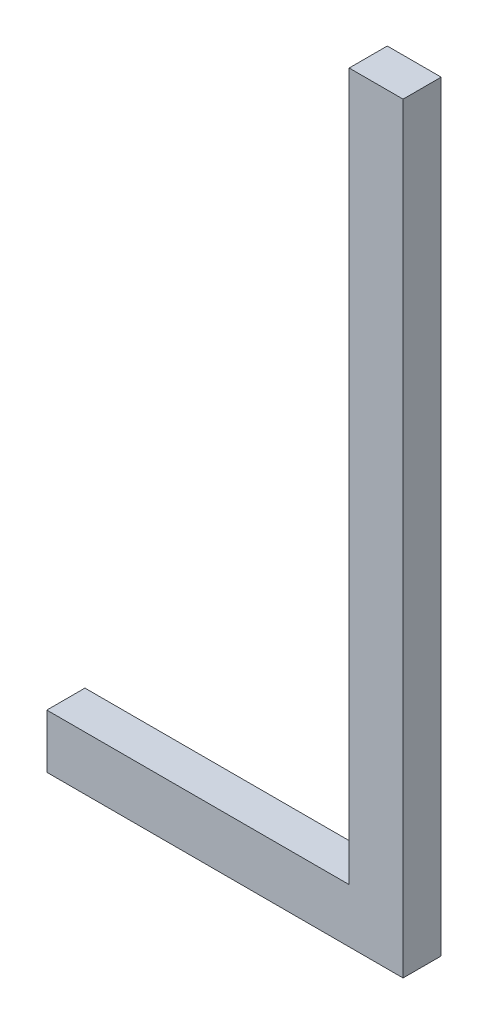
ISO-10303-21;
HEADER;
FILE_DESCRIPTION(('STEP AP214'),'2;1');
FILE_NAME('part.step','',(''),(''),'','','');
FILE_SCHEMA(('AUTOMOTIVE_DESIGN { 1 0 10303 214 1 1 1 1 }'));
ENDSEC;
DATA;
#1=APPLICATION_CONTEXT('core data for automotive mechanical design processes');
#2=APPLICATION_PROTOCOL_DEFINITION('international standard','automotive_design',2000,#1);
#3=PRODUCT_CONTEXT('',#1,'mechanical');
#4=PRODUCT('Part','Part','',(#3));
#5=PRODUCT_RELATED_PRODUCT_CATEGORY('part','',(#4));
#6=PRODUCT_DEFINITION_FORMATION('','',#4);
#7=PRODUCT_DEFINITION_CONTEXT('part definition',#1,'design');
#8=PRODUCT_DEFINITION('design','',#6,#7);
#9=PRODUCT_DEFINITION_SHAPE('','',#8);
#10=(LENGTH_UNIT() NAMED_UNIT(*) SI_UNIT(.MILLI.,.METRE.));
#11=(NAMED_UNIT(*) PLANE_ANGLE_UNIT() SI_UNIT($,.RADIAN.));
#12=(NAMED_UNIT(*) SI_UNIT($,.STERADIAN.) SOLID_ANGLE_UNIT());
#13=UNCERTAINTY_MEASURE_WITH_UNIT(LENGTH_MEASURE(1.E-05),#10,'distance_accuracy_value','');
#14=(GEOMETRIC_REPRESENTATION_CONTEXT(3) GLOBAL_UNCERTAINTY_ASSIGNED_CONTEXT((#13)) GLOBAL_UNIT_ASSIGNED_CONTEXT((#10,
#11,#12)) REPRESENTATION_CONTEXT('',''));
#15=CARTESIAN_POINT('',(0.,0.,0.));
#16=DIRECTION('',(0.,0.,1.));
#17=DIRECTION('',(1.,0.,0.));
#18=AXIS2_PLACEMENT_3D('',#15,#16,#17);
#19=CARTESIAN_POINT('',(64.7428887893903,65.7791772221511,-39.1));
#20=DIRECTION('',(0.,0.,1.));
#21=DIRECTION('',(1.,0.,0.));
#22=AXIS2_PLACEMENT_3D('',#19,#20,#21);
#23=PLANE('',#22);
#24=DIRECTION('',(1.,0.,0.));
#25=VECTOR('',#24,1.);
#26=CARTESIAN_POINT('',(64.7428887893903,65.9206474024611,-39.1));
#27=LINE('',#26,#25);
#28=CARTESIAN_POINT('',(65.5362313691903,65.9206474024611,-39.1));
#29=VERTEX_POINT('',#28);
#30=CARTESIAN_POINT('',(64.7428887893903,65.9206474024611,-39.1));
#31=VERTEX_POINT('',#30);
#32=EDGE_CURVE('E20',#29,#31,#27,.F.);
#33=ORIENTED_EDGE('',*,*,#32,.F.);
#34=DIRECTION('',(0.,1.,0.));
#35=VECTOR('',#34,1.);
#36=CARTESIAN_POINT('',(65.5362313691903,67.7764032970511,-39.1));
#37=LINE('',#36,#35);
#38=CARTESIAN_POINT('',(65.5362313691903,67.7764032970511,-39.1));
#39=VERTEX_POINT('',#38);
#40=EDGE_CURVE('E100',#29,#39,#37,.T.);
#41=ORIENTED_EDGE('',*,*,#40,.T.);
#42=DIRECTION('',(1.,0.,0.));
#43=VECTOR('',#42,1.);
#44=CARTESIAN_POINT('',(65.6777015494903,67.7764032970511,-39.1));
#45=LINE('',#44,#43);
#46=CARTESIAN_POINT('',(65.6777015494903,67.7764032970511,-39.1));
#47=VERTEX_POINT('',#46);
#48=EDGE_CURVE('E96',#39,#47,#45,.T.);
#49=ORIENTED_EDGE('',*,*,#48,.T.);
#50=DIRECTION('',(0.,1.,0.));
#51=VECTOR('',#50,1.);
#52=CARTESIAN_POINT('',(65.6777015494903,65.7791772221511,-39.1));
#53=LINE('',#52,#51);
#54=CARTESIAN_POINT('',(65.6777015494903,65.7791772221511,-39.1));
#55=VERTEX_POINT('',#54);
#56=EDGE_CURVE('E82',#47,#55,#53,.F.);
#57=ORIENTED_EDGE('',*,*,#56,.T.);
#58=DIRECTION('',(1.,0.,0.));
#59=VECTOR('',#58,1.);
#60=CARTESIAN_POINT('',(64.7428887893903,65.7791772221511,-39.1));
#61=LINE('',#60,#59);
#62=CARTESIAN_POINT('',(64.7428887893903,65.7791772221511,-39.1));
#63=VERTEX_POINT('',#62);
#64=EDGE_CURVE('E68',#55,#63,#61,.F.);
#65=ORIENTED_EDGE('',*,*,#64,.T.);
#66=DIRECTION('',(0.,1.,0.));
#67=VECTOR('',#66,1.);
#68=CARTESIAN_POINT('',(64.7428887893903,65.9206474024611,-39.1));
#69=LINE('',#68,#67);
#70=EDGE_CURVE('E74',#63,#31,#69,.T.);
#71=ORIENTED_EDGE('',*,*,#70,.T.);
#72=EDGE_LOOP('',(#33,#41,#49,#57,#65,#71));
#73=FACE_BOUND('',#72,.T.);
#74=ADVANCED_FACE('F17',(#73),#23,.F.);
#75=CARTESIAN_POINT('',(64.7428887893903,65.9206474024611,-39.));
#76=DIRECTION('',(1.,0.,0.));
#77=DIRECTION('',(0.,0.,-1.));
#78=AXIS2_PLACEMENT_3D('',#75,#76,#77);
#79=PLANE('',#78);
#80=DIRECTION('',(0.,0.,1.));
#81=VECTOR('',#80,1.);
#82=CARTESIAN_POINT('',(64.7428887893903,65.7791772221511,-39.));
#83=LINE('',#82,#81);
#84=CARTESIAN_POINT('',(64.7428887893903,65.7791772221511,-39.));
#85=VERTEX_POINT('',#84);
#86=EDGE_CURVE('E76',#63,#85,#83,.T.);
#87=ORIENTED_EDGE('',*,*,#86,.T.);
#88=DIRECTION('',(0.,1.,0.));
#89=VECTOR('',#88,1.);
#90=CARTESIAN_POINT('',(64.7428887893903,65.7791772221511,-39.));
#91=LINE('',#90,#89);
#92=CARTESIAN_POINT('',(64.7428887893903,65.9206474024611,-39.));
#93=VERTEX_POINT('',#92);
#94=EDGE_CURVE('E105',#93,#85,#91,.F.);
#95=ORIENTED_EDGE('',*,*,#94,.F.);
#96=DIRECTION('',(0.,0.,-1.));
#97=VECTOR('',#96,1.);
#98=CARTESIAN_POINT('',(64.7428887893903,65.9206474024611,-39.));
#99=LINE('',#98,#97);
#100=EDGE_CURVE('E79',#93,#31,#99,.T.);
#101=ORIENTED_EDGE('',*,*,#100,.T.);
#102=ORIENTED_EDGE('',*,*,#70,.F.);
#103=EDGE_LOOP('',(#87,#95,#101,#102));
#104=FACE_BOUND('',#103,.T.);
#105=ADVANCED_FACE('F75',(#104),#79,.F.);
#106=CARTESIAN_POINT('',(64.7428887893903,65.7791772221511,-39.));
#107=DIRECTION('',(0.,1.,0.));
#108=DIRECTION('',(0.,0.,1.));
#109=AXIS2_PLACEMENT_3D('',#106,#107,#108);
#110=PLANE('',#109);
#111=DIRECTION('',(0.,0.,1.));
#112=VECTOR('',#111,1.);
#113=CARTESIAN_POINT('',(65.6777015494903,65.7791772221511,-39.));
#114=LINE('',#113,#112);
#115=CARTESIAN_POINT('',(65.6777015494903,65.7791772221511,-39.));
#116=VERTEX_POINT('',#115);
#117=EDGE_CURVE('E84',#55,#116,#114,.T.);
#118=ORIENTED_EDGE('',*,*,#117,.T.);
#119=DIRECTION('',(1.,0.,0.));
#120=VECTOR('',#119,1.);
#121=CARTESIAN_POINT('',(64.7428887893903,65.7791772221511,-39.));
#122=LINE('',#121,#120);
#123=EDGE_CURVE('E88',#85,#116,#122,.T.);
#124=ORIENTED_EDGE('',*,*,#123,.F.);
#125=ORIENTED_EDGE('',*,*,#86,.F.);
#126=ORIENTED_EDGE('',*,*,#64,.F.);
#127=EDGE_LOOP('',(#118,#124,#125,#126));
#128=FACE_BOUND('',#127,.T.);
#129=ADVANCED_FACE('F86',(#128),#110,.F.);
#130=CARTESIAN_POINT('',(65.6777015494903,65.7791772221511,-39.));
#131=DIRECTION('',(-1.,0.,0.));
#132=DIRECTION('',(0.,0.,1.));
#133=AXIS2_PLACEMENT_3D('',#130,#131,#132);
#134=PLANE('',#133);
#135=DIRECTION('',(0.,0.,-1.));
#136=VECTOR('',#135,1.);
#137=CARTESIAN_POINT('',(65.6777015494903,67.7764032970511,-39.));
#138=LINE('',#137,#136);
#139=CARTESIAN_POINT('',(65.6777015494903,67.7764032970511,-39.));
#140=VERTEX_POINT('',#139);
#141=EDGE_CURVE('E94',#47,#140,#138,.F.);
#142=ORIENTED_EDGE('',*,*,#141,.T.);
#143=DIRECTION('',(0.,1.,0.));
#144=VECTOR('',#143,1.);
#145=CARTESIAN_POINT('',(65.6777015494903,65.7791772221511,-39.));
#146=LINE('',#145,#144);
#147=EDGE_CURVE('E108',#116,#140,#146,.T.);
#148=ORIENTED_EDGE('',*,*,#147,.F.);
#149=ORIENTED_EDGE('',*,*,#117,.F.);
#150=ORIENTED_EDGE('',*,*,#56,.F.);
#151=EDGE_LOOP('',(#142,#148,#149,#150));
#152=FACE_BOUND('',#151,.T.);
#153=ADVANCED_FACE('F137',(#152),#134,.F.);
#154=CARTESIAN_POINT('',(65.6777015494903,67.7764032970511,-39.));
#155=DIRECTION('',(0.,-1.,0.));
#156=DIRECTION('',(0.,0.,-1.));
#157=AXIS2_PLACEMENT_3D('',#154,#155,#156);
#158=PLANE('',#157);
#159=DIRECTION('',(0.,0.,-1.));
#160=VECTOR('',#159,1.);
#161=CARTESIAN_POINT('',(65.5362313691903,67.7764032970511,-39.));
#162=LINE('',#161,#160);
#163=CARTESIAN_POINT('',(65.5362313691903,67.7764032970511,-39.));
#164=VERTEX_POINT('',#163);
#165=EDGE_CURVE('E98',#39,#164,#162,.F.);
#166=ORIENTED_EDGE('',*,*,#165,.T.);
#167=DIRECTION('',(1.,0.,0.));
#168=VECTOR('',#167,1.);
#169=CARTESIAN_POINT('',(64.7428887893903,67.7764032970511,-39.));
#170=LINE('',#169,#168);
#171=EDGE_CURVE('E111',#140,#164,#170,.F.);
#172=ORIENTED_EDGE('',*,*,#171,.F.);
#173=ORIENTED_EDGE('',*,*,#141,.F.);
#174=ORIENTED_EDGE('',*,*,#48,.F.);
#175=EDGE_LOOP('',(#166,#172,#173,#174));
#176=FACE_BOUND('',#175,.T.);
#177=ADVANCED_FACE('F121',(#176),#158,.F.);
#178=CARTESIAN_POINT('',(65.5362313691903,67.7764032970511,-39.));
#179=DIRECTION('',(1.,0.,0.));
#180=DIRECTION('',(0.,0.,-1.));
#181=AXIS2_PLACEMENT_3D('',#178,#179,#180);
#182=PLANE('',#181);
#183=DIRECTION('',(0.,0.,-1.));
#184=VECTOR('',#183,1.);
#185=CARTESIAN_POINT('',(65.5362313691903,65.9206474024611,-39.));
#186=LINE('',#185,#184);
#187=CARTESIAN_POINT('',(65.5362313691903,65.9206474024611,-39.));
#188=VERTEX_POINT('',#187);
#189=EDGE_CURVE('E35',#29,#188,#186,.F.);
#190=ORIENTED_EDGE('',*,*,#189,.T.);
#191=DIRECTION('',(0.,1.,0.));
#192=VECTOR('',#191,1.);
#193=CARTESIAN_POINT('',(65.5362313691903,65.7791772221511,-39.));
#194=LINE('',#193,#192);
#195=EDGE_CURVE('E26',#164,#188,#194,.F.);
#196=ORIENTED_EDGE('',*,*,#195,.F.);
#197=ORIENTED_EDGE('',*,*,#165,.F.);
#198=ORIENTED_EDGE('',*,*,#40,.F.);
#199=EDGE_LOOP('',(#190,#196,#197,#198));
#200=FACE_BOUND('',#199,.T.);
#201=ADVANCED_FACE('F119',(#200),#182,.F.);
#202=CARTESIAN_POINT('',(65.5362313691903,65.9206474024611,-39.));
#203=DIRECTION('',(0.,-1.,0.));
#204=DIRECTION('',(0.,0.,-1.));
#205=AXIS2_PLACEMENT_3D('',#202,#203,#204);
#206=PLANE('',#205);
#207=ORIENTED_EDGE('',*,*,#100,.F.);
#208=DIRECTION('',(1.,0.,0.));
#209=VECTOR('',#208,1.);
#210=CARTESIAN_POINT('',(64.7428887893903,65.9206474024611,-39.));
#211=LINE('',#210,#209);
#212=EDGE_CURVE('E11',#188,#93,#211,.F.);
#213=ORIENTED_EDGE('',*,*,#212,.F.);
#214=ORIENTED_EDGE('',*,*,#189,.F.);
#215=ORIENTED_EDGE('',*,*,#32,.T.);
#216=EDGE_LOOP('',(#207,#213,#214,#215));
#217=FACE_BOUND('',#216,.T.);
#218=ADVANCED_FACE('F124',(#217),#206,.F.);
#219=CARTESIAN_POINT('',(64.7428887893903,65.7791772221511,-39.));
#220=DIRECTION('',(0.,0.,1.));
#221=DIRECTION('',(1.,0.,0.));
#222=AXIS2_PLACEMENT_3D('',#219,#220,#221);
#223=PLANE('',#222);
#224=ORIENTED_EDGE('',*,*,#195,.T.);
#225=ORIENTED_EDGE('',*,*,#212,.T.);
#226=ORIENTED_EDGE('',*,*,#94,.T.);
#227=ORIENTED_EDGE('',*,*,#123,.T.);
#228=ORIENTED_EDGE('',*,*,#147,.T.);
#229=ORIENTED_EDGE('',*,*,#171,.T.);
#230=EDGE_LOOP('',(#224,#225,#226,#227,#228,#229));
#231=FACE_BOUND('',#230,.T.);
#232=ADVANCED_FACE('F116',(#231),#223,.T.);
#233=CLOSED_SHELL('',(#74,#105,#129,#153,#177,#201,#218,#232));
#234=MANIFOLD_SOLID_BREP('B1',#233);
#235=ADVANCED_BREP_SHAPE_REPRESENTATION('',(#18,#234),#14);
#236=SHAPE_DEFINITION_REPRESENTATION(#9,#235);
ENDSEC;
END-ISO-10303-21;
